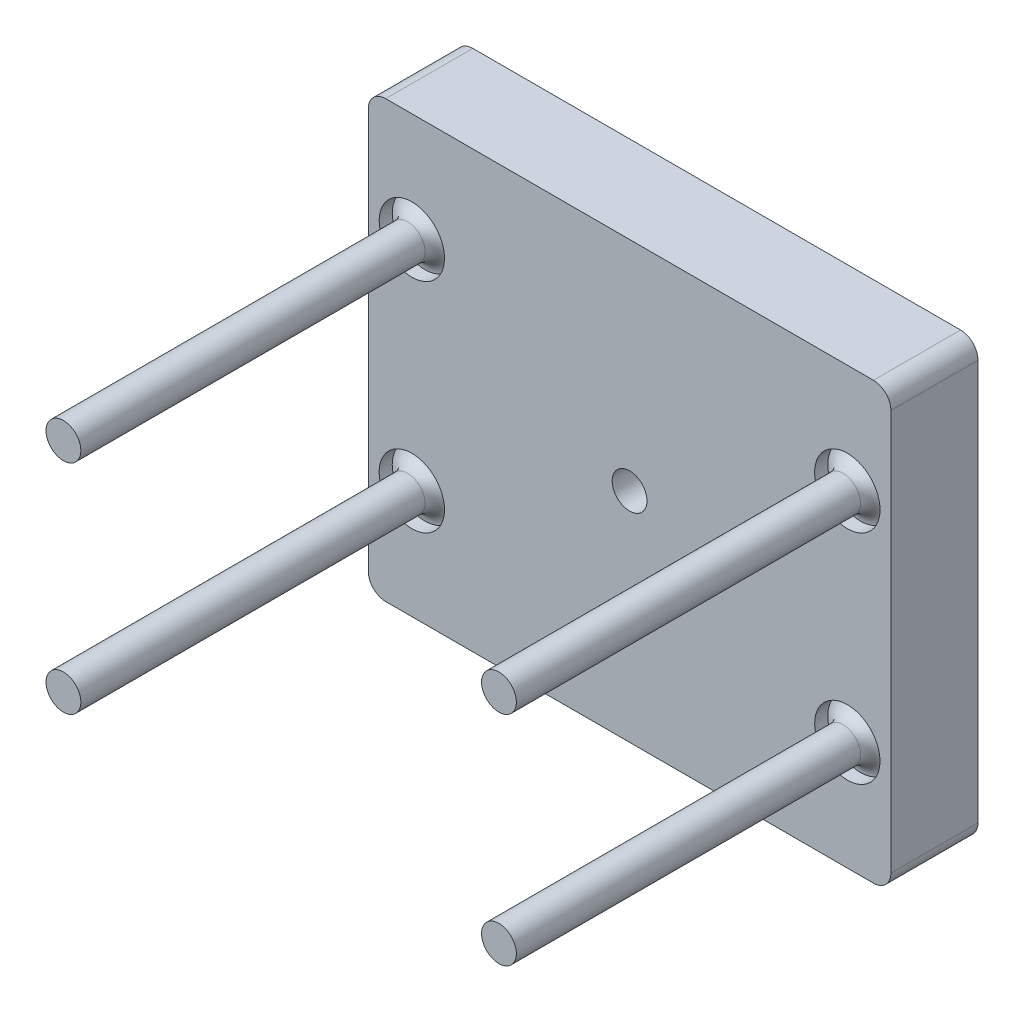
ISO-10303-21;
HEADER;
FILE_DESCRIPTION(('STEP AP214'),'2;1');
FILE_NAME('part.step','',(''),(''),'','','');
FILE_SCHEMA(('AUTOMOTIVE_DESIGN { 1 0 10303 214 1 1 1 1 }'));
ENDSEC;
DATA;
#1=APPLICATION_CONTEXT('core data for automotive mechanical design processes');
#2=APPLICATION_PROTOCOL_DEFINITION('international standard','automotive_design',2000,#1);
#3=PRODUCT_CONTEXT('',#1,'mechanical');
#4=PRODUCT('Part','Part','',(#3));
#5=PRODUCT_RELATED_PRODUCT_CATEGORY('part','',(#4));
#6=PRODUCT_DEFINITION_FORMATION('','',#4);
#7=PRODUCT_DEFINITION_CONTEXT('part definition',#1,'design');
#8=PRODUCT_DEFINITION('design','',#6,#7);
#9=PRODUCT_DEFINITION_SHAPE('','',#8);
#10=(LENGTH_UNIT() NAMED_UNIT(*) SI_UNIT(.MILLI.,.METRE.));
#11=(NAMED_UNIT(*) PLANE_ANGLE_UNIT() SI_UNIT($,.RADIAN.));
#12=(NAMED_UNIT(*) SI_UNIT($,.STERADIAN.) SOLID_ANGLE_UNIT());
#13=UNCERTAINTY_MEASURE_WITH_UNIT(LENGTH_MEASURE(1.E-05),#10,'distance_accuracy_value','');
#14=(GEOMETRIC_REPRESENTATION_CONTEXT(3) GLOBAL_UNCERTAINTY_ASSIGNED_CONTEXT((#13)) GLOBAL_UNIT_ASSIGNED_CONTEXT((#10,
#11,#12)) REPRESENTATION_CONTEXT('',''));
#15=CARTESIAN_POINT('',(0.,0.,0.));
#16=DIRECTION('',(0.,0.,1.));
#17=DIRECTION('',(1.,0.,0.));
#18=AXIS2_PLACEMENT_3D('',#15,#16,#17);
#19=CARTESIAN_POINT('',(0.,0.,5.));
#20=DIRECTION('',(1.,0.,0.));
#21=DIRECTION('',(0.,1.,0.));
#22=AXIS2_PLACEMENT_3D('',#19,#20,#21);
#23=PLANE('',#22);
#24=DIRECTION('',(0.,-1.,0.));
#25=VECTOR('',#24,1.);
#26=CARTESIAN_POINT('',(0.,0.,-5.));
#27=LINE('',#26,#25);
#28=CARTESIAN_POINT('',(0.,-2.,-5.));
#29=VERTEX_POINT('',#28);
#30=CARTESIAN_POINT('',(0.,-48.,-5.));
#31=VERTEX_POINT('',#30);
#32=EDGE_CURVE('E123',#29,#31,#27,.T.);
#33=ORIENTED_EDGE('',*,*,#32,.T.);
#34=DIRECTION('',(0.,0.,-1.));
#35=VECTOR('',#34,1.);
#36=CARTESIAN_POINT('',(0.,-48.,5.));
#37=LINE('',#36,#35);
#38=CARTESIAN_POINT('',(0.,-48.,5.));
#39=VERTEX_POINT('',#38);
#40=EDGE_CURVE('E173',#31,#39,#37,.F.);
#41=ORIENTED_EDGE('',*,*,#40,.T.);
#42=DIRECTION('',(0.,-1.,0.));
#43=VECTOR('',#42,1.);
#44=CARTESIAN_POINT('',(0.,0.,5.));
#45=LINE('',#44,#43);
#46=CARTESIAN_POINT('',(0.,-2.,5.));
#47=VERTEX_POINT('',#46);
#48=EDGE_CURVE('E126',#47,#39,#45,.T.);
#49=ORIENTED_EDGE('',*,*,#48,.F.);
#50=DIRECTION('',(0.,0.,-1.));
#51=VECTOR('',#50,1.);
#52=CARTESIAN_POINT('',(0.,-2.,5.));
#53=LINE('',#52,#51);
#54=EDGE_CURVE('E112',#47,#29,#53,.T.);
#55=ORIENTED_EDGE('',*,*,#54,.T.);
#56=EDGE_LOOP('',(#33,#41,#49,#55));
#57=FACE_BOUND('',#56,.T.);
#58=ADVANCED_FACE('F39',(#57),#23,.F.);
#59=CARTESIAN_POINT('',(0.,-50.,5.));
#60=DIRECTION('',(0.,1.,0.));
#61=DIRECTION('',(0.,0.,1.));
#62=AXIS2_PLACEMENT_3D('',#59,#60,#61);
#63=PLANE('',#62);
#64=DIRECTION('',(1.,0.,0.));
#65=VECTOR('',#64,1.);
#66=CARTESIAN_POINT('',(0.,-50.,5.));
#67=LINE('',#66,#65);
#68=CARTESIAN_POINT('',(2.00000000000001,-50.,5.));
#69=VERTEX_POINT('',#68);
#70=CARTESIAN_POINT('',(58.,-50.,5.));
#71=VERTEX_POINT('',#70);
#72=EDGE_CURVE('E285',#69,#71,#67,.T.);
#73=ORIENTED_EDGE('',*,*,#72,.F.);
#74=DIRECTION('',(0.,0.,-1.));
#75=VECTOR('',#74,1.);
#76=CARTESIAN_POINT('',(2.00000000000001,-50.,5.));
#77=LINE('',#76,#75);
#78=CARTESIAN_POINT('',(2.00000000000001,-50.,-5.));
#79=VERTEX_POINT('',#78);
#80=EDGE_CURVE('E161',#69,#79,#77,.T.);
#81=ORIENTED_EDGE('',*,*,#80,.T.);
#82=DIRECTION('',(1.,0.,0.));
#83=VECTOR('',#82,1.);
#84=CARTESIAN_POINT('',(0.,-50.,-5.));
#85=LINE('',#84,#83);
#86=CARTESIAN_POINT('',(58.,-50.,-5.));
#87=VERTEX_POINT('',#86);
#88=EDGE_CURVE('E134',#79,#87,#85,.T.);
#89=ORIENTED_EDGE('',*,*,#88,.T.);
#90=DIRECTION('',(0.,0.,-1.));
#91=VECTOR('',#90,1.);
#92=CARTESIAN_POINT('',(58.,-50.,5.));
#93=LINE('',#92,#91);
#94=EDGE_CURVE('E158',#87,#71,#93,.F.);
#95=ORIENTED_EDGE('',*,*,#94,.T.);
#96=EDGE_LOOP('',(#73,#81,#89,#95));
#97=FACE_BOUND('',#96,.T.);
#98=ADVANCED_FACE('F222',(#97),#63,.F.);
#99=CARTESIAN_POINT('',(60.,0.,5.));
#100=DIRECTION('',(-1.,0.,0.));
#101=DIRECTION('',(0.,-1.,0.));
#102=AXIS2_PLACEMENT_3D('',#99,#100,#101);
#103=PLANE('',#102);
#104=DIRECTION('',(0.,1.,0.));
#105=VECTOR('',#104,1.);
#106=CARTESIAN_POINT('',(60.,0.,5.));
#107=LINE('',#106,#105);
#108=CARTESIAN_POINT('',(60.,-48.,5.));
#109=VERTEX_POINT('',#108);
#110=CARTESIAN_POINT('',(60.,-2.,5.));
#111=VERTEX_POINT('',#110);
#112=EDGE_CURVE('E287',#109,#111,#107,.T.);
#113=ORIENTED_EDGE('',*,*,#112,.F.);
#114=DIRECTION('',(0.,0.,-1.));
#115=VECTOR('',#114,1.);
#116=CARTESIAN_POINT('',(60.,-48.,5.));
#117=LINE('',#116,#115);
#118=CARTESIAN_POINT('',(60.,-48.,-5.));
#119=VERTEX_POINT('',#118);
#120=EDGE_CURVE('E186',#109,#119,#117,.T.);
#121=ORIENTED_EDGE('',*,*,#120,.T.);
#122=DIRECTION('',(0.,1.,0.));
#123=VECTOR('',#122,1.);
#124=CARTESIAN_POINT('',(60.,0.,-5.));
#125=LINE('',#124,#123);
#126=CARTESIAN_POINT('',(60.,-2.,-5.));
#127=VERTEX_POINT('',#126);
#128=EDGE_CURVE('E140',#119,#127,#125,.T.);
#129=ORIENTED_EDGE('',*,*,#128,.T.);
#130=DIRECTION('',(0.,0.,-1.));
#131=VECTOR('',#130,1.);
#132=CARTESIAN_POINT('',(60.,-2.,5.));
#133=LINE('',#132,#131);
#134=EDGE_CURVE('E55',#127,#111,#133,.F.);
#135=ORIENTED_EDGE('',*,*,#134,.T.);
#136=EDGE_LOOP('',(#113,#121,#129,#135));
#137=FACE_BOUND('',#136,.T.);
#138=ADVANCED_FACE('F227',(#137),#103,.F.);
#139=CARTESIAN_POINT('',(0.,0.,5.));
#140=DIRECTION('',(0.,-1.,0.));
#141=DIRECTION('',(0.,0.,-1.));
#142=AXIS2_PLACEMENT_3D('',#139,#140,#141);
#143=PLANE('',#142);
#144=DIRECTION('',(-1.,0.,0.));
#145=VECTOR('',#144,1.);
#146=CARTESIAN_POINT('',(0.,0.,5.));
#147=LINE('',#146,#145);
#148=CARTESIAN_POINT('',(58.,0.,5.));
#149=VERTEX_POINT('',#148);
#150=CARTESIAN_POINT('',(2.,0.,5.));
#151=VERTEX_POINT('',#150);
#152=EDGE_CURVE('E128',#149,#151,#147,.T.);
#153=ORIENTED_EDGE('',*,*,#152,.F.);
#154=DIRECTION('',(0.,0.,-1.));
#155=VECTOR('',#154,1.);
#156=CARTESIAN_POINT('',(58.,0.,5.));
#157=LINE('',#156,#155);
#158=CARTESIAN_POINT('',(58.,0.,-5.));
#159=VERTEX_POINT('',#158);
#160=EDGE_CURVE('E190',#149,#159,#157,.T.);
#161=ORIENTED_EDGE('',*,*,#160,.T.);
#162=DIRECTION('',(-1.,0.,0.));
#163=VECTOR('',#162,1.);
#164=CARTESIAN_POINT('',(0.,0.,-5.));
#165=LINE('',#164,#163);
#166=CARTESIAN_POINT('',(2.,0.,-5.));
#167=VERTEX_POINT('',#166);
#168=EDGE_CURVE('E150',#159,#167,#165,.T.);
#169=ORIENTED_EDGE('',*,*,#168,.T.);
#170=DIRECTION('',(0.,0.,-1.));
#171=VECTOR('',#170,1.);
#172=CARTESIAN_POINT('',(2.,0.,5.));
#173=LINE('',#172,#171);
#174=EDGE_CURVE('E114',#167,#151,#173,.F.);
#175=ORIENTED_EDGE('',*,*,#174,.T.);
#176=EDGE_LOOP('',(#153,#161,#169,#175));
#177=FACE_BOUND('',#176,.T.);
#178=ADVANCED_FACE('F295',(#177),#143,.F.);
#179=CARTESIAN_POINT('',(0.,0.,5.));
#180=DIRECTION('',(0.,0.,1.));
#181=DIRECTION('',(1.,0.,0.));
#182=AXIS2_PLACEMENT_3D('',#179,#180,#181);
#183=PLANE('',#182);
#184=CARTESIAN_POINT('',(55.,-37.5,5.));
#185=DIRECTION('',(0.,0.,1.));
#186=DIRECTION('',(-1.,0.,0.));
#187=AXIS2_PLACEMENT_3D('',#184,#185,#186);
#188=CIRCLE('',#187,3.75);
#189=CARTESIAN_POINT('',(51.25,-37.5,5.));
#190=VERTEX_POINT('',#189);
#191=EDGE_CURVE('E376',#190,#190,#188,.T.);
#192=ORIENTED_EDGE('',*,*,#191,.F.);
#193=EDGE_LOOP('',(#192));
#194=FACE_BOUND('',#193,.T.);
#195=CARTESIAN_POINT('',(55.,-12.5,5.));
#196=DIRECTION('',(0.,0.,1.));
#197=DIRECTION('',(1.,0.,0.));
#198=AXIS2_PLACEMENT_3D('',#195,#196,#197);
#199=CIRCLE('',#198,3.75);
#200=CARTESIAN_POINT('',(58.75,-12.5,5.));
#201=VERTEX_POINT('',#200);
#202=EDGE_CURVE('E368',#201,#201,#199,.T.);
#203=ORIENTED_EDGE('',*,*,#202,.F.);
#204=EDGE_LOOP('',(#203));
#205=FACE_BOUND('',#204,.T.);
#206=CARTESIAN_POINT('',(5.,-12.5,5.));
#207=DIRECTION('',(0.,0.,1.));
#208=DIRECTION('',(-1.,0.,0.));
#209=AXIS2_PLACEMENT_3D('',#206,#207,#208);
#210=CIRCLE('',#209,3.75);
#211=CARTESIAN_POINT('',(1.25,-12.5,5.));
#212=VERTEX_POINT('',#211);
#213=EDGE_CURVE('E358',#212,#212,#210,.T.);
#214=ORIENTED_EDGE('',*,*,#213,.F.);
#215=EDGE_LOOP('',(#214));
#216=FACE_BOUND('',#215,.T.);
#217=CARTESIAN_POINT('',(5.,-37.5,5.));
#218=DIRECTION('',(0.,0.,1.));
#219=DIRECTION('',(1.,0.,0.));
#220=AXIS2_PLACEMENT_3D('',#217,#218,#219);
#221=CIRCLE('',#220,3.75);
#222=CARTESIAN_POINT('',(8.75,-37.5,5.));
#223=VERTEX_POINT('',#222);
#224=EDGE_CURVE('E365',#223,#223,#221,.T.);
#225=ORIENTED_EDGE('',*,*,#224,.F.);
#226=EDGE_LOOP('',(#225));
#227=FACE_BOUND('',#226,.T.);
#228=CARTESIAN_POINT('',(30.,-25.,5.));
#229=DIRECTION('',(0.,0.,1.));
#230=DIRECTION('',(1.,0.,0.));
#231=AXIS2_PLACEMENT_3D('',#228,#229,#230);
#232=CIRCLE('',#231,2.);
#233=CARTESIAN_POINT('',(32.,-25.,5.));
#234=VERTEX_POINT('',#233);
#235=EDGE_CURVE('E384',#234,#234,#232,.T.);
#236=ORIENTED_EDGE('',*,*,#235,.F.);
#237=EDGE_LOOP('',(#236));
#238=FACE_BOUND('',#237,.T.);
#239=ORIENTED_EDGE('',*,*,#48,.T.);
#240=CARTESIAN_POINT('',(2.00000000000001,-48.,5.));
#241=DIRECTION('',(0.,0.,1.));
#242=DIRECTION('',(1.,0.,0.));
#243=AXIS2_PLACEMENT_3D('',#240,#241,#242);
#244=CIRCLE('',#243,2.);
#245=EDGE_CURVE('E181',#39,#69,#244,.T.);
#246=ORIENTED_EDGE('',*,*,#245,.T.);
#247=ORIENTED_EDGE('',*,*,#72,.T.);
#248=CARTESIAN_POINT('',(58.,-48.,5.));
#249=DIRECTION('',(0.,0.,1.));
#250=DIRECTION('',(1.,0.,0.));
#251=AXIS2_PLACEMENT_3D('',#248,#249,#250);
#252=CIRCLE('',#251,2.);
#253=EDGE_CURVE('E62',#71,#109,#252,.T.);
#254=ORIENTED_EDGE('',*,*,#253,.T.);
#255=ORIENTED_EDGE('',*,*,#112,.T.);
#256=CARTESIAN_POINT('',(58.,-2.,5.));
#257=DIRECTION('',(0.,0.,1.));
#258=DIRECTION('',(1.,0.,0.));
#259=AXIS2_PLACEMENT_3D('',#256,#257,#258);
#260=CIRCLE('',#259,2.);
#261=EDGE_CURVE('E176',#111,#149,#260,.T.);
#262=ORIENTED_EDGE('',*,*,#261,.T.);
#263=ORIENTED_EDGE('',*,*,#152,.T.);
#264=CARTESIAN_POINT('',(2.,-2.,5.));
#265=DIRECTION('',(0.,0.,1.));
#266=DIRECTION('',(1.,0.,0.));
#267=AXIS2_PLACEMENT_3D('',#264,#265,#266);
#268=CIRCLE('',#267,2.);
#269=EDGE_CURVE('E155',#151,#47,#268,.T.);
#270=ORIENTED_EDGE('',*,*,#269,.T.);
#271=EDGE_LOOP('',(#239,#246,#247,#254,#255,#262,#263,#270));
#272=FACE_BOUND('',#271,.T.);
#273=ADVANCED_FACE('F292',(#194,#205,#216,#227,#238,#272),#183,.T.);
#274=CARTESIAN_POINT('',(0.,0.,-5.));
#275=DIRECTION('',(0.,0.,1.));
#276=DIRECTION('',(1.,0.,0.));
#277=AXIS2_PLACEMENT_3D('',#274,#275,#276);
#278=PLANE('',#277);
#279=CARTESIAN_POINT('',(30.,-25.,-5.));
#280=DIRECTION('',(0.,0.,1.));
#281=DIRECTION('',(1.,0.,0.));
#282=AXIS2_PLACEMENT_3D('',#279,#280,#281);
#283=CIRCLE('',#282,2.);
#284=CARTESIAN_POINT('',(32.,-25.,-5.));
#285=VERTEX_POINT('',#284);
#286=EDGE_CURVE('E279',#285,#285,#283,.T.);
#287=ORIENTED_EDGE('',*,*,#286,.T.);
#288=EDGE_LOOP('',(#287));
#289=FACE_BOUND('',#288,.T.);
#290=ORIENTED_EDGE('',*,*,#88,.F.);
#291=CARTESIAN_POINT('',(2.00000000000001,-48.,-5.));
#292=DIRECTION('',(0.,0.,1.));
#293=DIRECTION('',(1.,0.,0.));
#294=AXIS2_PLACEMENT_3D('',#291,#292,#293);
#295=CIRCLE('',#294,2.);
#296=EDGE_CURVE('E132',#79,#31,#295,.F.);
#297=ORIENTED_EDGE('',*,*,#296,.T.);
#298=ORIENTED_EDGE('',*,*,#32,.F.);
#299=CARTESIAN_POINT('',(2.,-2.,-5.));
#300=DIRECTION('',(0.,0.,1.));
#301=DIRECTION('',(1.,0.,0.));
#302=AXIS2_PLACEMENT_3D('',#299,#300,#301);
#303=CIRCLE('',#302,2.);
#304=EDGE_CURVE('E108',#29,#167,#303,.F.);
#305=ORIENTED_EDGE('',*,*,#304,.T.);
#306=ORIENTED_EDGE('',*,*,#168,.F.);
#307=CARTESIAN_POINT('',(58.,-2.,-5.));
#308=DIRECTION('',(0.,0.,1.));
#309=DIRECTION('',(1.,0.,0.));
#310=AXIS2_PLACEMENT_3D('',#307,#308,#309);
#311=CIRCLE('',#310,2.);
#312=EDGE_CURVE('E165',#159,#127,#311,.F.);
#313=ORIENTED_EDGE('',*,*,#312,.T.);
#314=ORIENTED_EDGE('',*,*,#128,.F.);
#315=CARTESIAN_POINT('',(58.,-48.,-5.));
#316=DIRECTION('',(0.,0.,1.));
#317=DIRECTION('',(1.,0.,0.));
#318=AXIS2_PLACEMENT_3D('',#315,#316,#317);
#319=CIRCLE('',#318,2.);
#320=EDGE_CURVE('E168',#119,#87,#319,.F.);
#321=ORIENTED_EDGE('',*,*,#320,.T.);
#322=EDGE_LOOP('',(#290,#297,#298,#305,#306,#313,#314,#321));
#323=FACE_BOUND('',#322,.T.);
#324=ADVANCED_FACE('F131',(#289,#323),#278,.F.);
#325=CARTESIAN_POINT('',(30.,-25.,-5.));
#326=DIRECTION('',(0.,0.,1.));
#327=DIRECTION('',(1.,0.,0.));
#328=AXIS2_PLACEMENT_3D('',#325,#326,#327);
#329=CYLINDRICAL_SURFACE('',#328,2.);
#330=ORIENTED_EDGE('',*,*,#286,.F.);
#331=EDGE_LOOP('',(#330));
#332=FACE_BOUND('',#331,.T.);
#333=ORIENTED_EDGE('',*,*,#235,.T.);
#334=EDGE_LOOP('',(#333));
#335=FACE_BOUND('',#334,.T.);
#336=ADVANCED_FACE('F235',(#332,#335),#329,.F.);
#337=CARTESIAN_POINT('',(2.,-2.,5.));
#338=DIRECTION('',(0.,0.,-1.));
#339=DIRECTION('',(-1.,0.,0.));
#340=AXIS2_PLACEMENT_3D('',#337,#338,#339);
#341=CYLINDRICAL_SURFACE('',#340,2.);
#342=ORIENTED_EDGE('',*,*,#269,.F.);
#343=ORIENTED_EDGE('',*,*,#174,.F.);
#344=ORIENTED_EDGE('',*,*,#304,.F.);
#345=ORIENTED_EDGE('',*,*,#54,.F.);
#346=EDGE_LOOP('',(#342,#343,#344,#345));
#347=FACE_BOUND('',#346,.T.);
#348=ADVANCED_FACE('F111',(#347),#341,.T.);
#349=CARTESIAN_POINT('',(2.00000000000001,-48.,5.));
#350=DIRECTION('',(0.,0.,-1.));
#351=DIRECTION('',(-1.,0.,0.));
#352=AXIS2_PLACEMENT_3D('',#349,#350,#351);
#353=CYLINDRICAL_SURFACE('',#352,2.);
#354=ORIENTED_EDGE('',*,*,#245,.F.);
#355=ORIENTED_EDGE('',*,*,#40,.F.);
#356=ORIENTED_EDGE('',*,*,#296,.F.);
#357=ORIENTED_EDGE('',*,*,#80,.F.);
#358=EDGE_LOOP('',(#354,#355,#356,#357));
#359=FACE_BOUND('',#358,.T.);
#360=ADVANCED_FACE('F234',(#359),#353,.T.);
#361=CARTESIAN_POINT('',(58.,-48.,5.));
#362=DIRECTION('',(0.,0.,-1.));
#363=DIRECTION('',(-1.,0.,0.));
#364=AXIS2_PLACEMENT_3D('',#361,#362,#363);
#365=CYLINDRICAL_SURFACE('',#364,2.);
#366=ORIENTED_EDGE('',*,*,#253,.F.);
#367=ORIENTED_EDGE('',*,*,#94,.F.);
#368=ORIENTED_EDGE('',*,*,#320,.F.);
#369=ORIENTED_EDGE('',*,*,#120,.F.);
#370=EDGE_LOOP('',(#366,#367,#368,#369));
#371=FACE_BOUND('',#370,.T.);
#372=ADVANCED_FACE('F238',(#371),#365,.T.);
#373=CARTESIAN_POINT('',(58.,-2.,5.));
#374=DIRECTION('',(0.,0.,-1.));
#375=DIRECTION('',(-1.,0.,0.));
#376=AXIS2_PLACEMENT_3D('',#373,#374,#375);
#377=CYLINDRICAL_SURFACE('',#376,2.);
#378=ORIENTED_EDGE('',*,*,#261,.F.);
#379=ORIENTED_EDGE('',*,*,#134,.F.);
#380=ORIENTED_EDGE('',*,*,#312,.F.);
#381=ORIENTED_EDGE('',*,*,#160,.F.);
#382=EDGE_LOOP('',(#378,#379,#380,#381));
#383=FACE_BOUND('',#382,.T.);
#384=ADVANCED_FACE('F242',(#383),#377,.T.);
#385=CARTESIAN_POINT('',(55.,-12.5,3.5));
#386=DIRECTION('',(0.,0.,1.));
#387=DIRECTION('',(1.,0.,0.));
#388=AXIS2_PLACEMENT_3D('',#385,#386,#387);
#389=CYLINDRICAL_SURFACE('',#388,3.75);
#390=CARTESIAN_POINT('',(55.,-12.5,3.5));
#391=DIRECTION('',(0.,0.,1.));
#392=DIRECTION('',(1.,0.,0.));
#393=AXIS2_PLACEMENT_3D('',#390,#391,#392);
#394=CIRCLE('',#393,3.75);
#395=CARTESIAN_POINT('',(58.75,-12.5,3.5));
#396=VERTEX_POINT('',#395);
#397=EDGE_CURVE('E361',#396,#396,#394,.T.);
#398=ORIENTED_EDGE('',*,*,#397,.F.);
#399=EDGE_LOOP('',(#398));
#400=FACE_BOUND('',#399,.T.);
#401=ORIENTED_EDGE('',*,*,#202,.T.);
#402=EDGE_LOOP('',(#401));
#403=FACE_BOUND('',#402,.T.);
#404=ADVANCED_FACE('F246',(#400,#403),#389,.F.);
#405=CARTESIAN_POINT('',(55.,-37.5,3.5));
#406=DIRECTION('',(0.,0.,1.));
#407=DIRECTION('',(1.,0.,0.));
#408=AXIS2_PLACEMENT_3D('',#405,#406,#407);
#409=CYLINDRICAL_SURFACE('',#408,3.75);
#410=CARTESIAN_POINT('',(55.,-37.5,3.5));
#411=DIRECTION('',(0.,0.,1.));
#412=DIRECTION('',(-1.,0.,0.));
#413=AXIS2_PLACEMENT_3D('',#410,#411,#412);
#414=CIRCLE('',#413,3.75);
#415=CARTESIAN_POINT('',(51.25,-37.5,3.5));
#416=VERTEX_POINT('',#415);
#417=EDGE_CURVE('E258',#416,#416,#414,.T.);
#418=ORIENTED_EDGE('',*,*,#417,.F.);
#419=EDGE_LOOP('',(#418));
#420=FACE_BOUND('',#419,.T.);
#421=ORIENTED_EDGE('',*,*,#191,.T.);
#422=EDGE_LOOP('',(#421));
#423=FACE_BOUND('',#422,.T.);
#424=ADVANCED_FACE('F341',(#420,#423),#409,.F.);
#425=CARTESIAN_POINT('',(5.,-37.5,3.5));
#426=DIRECTION('',(0.,0.,1.));
#427=DIRECTION('',(1.,0.,0.));
#428=AXIS2_PLACEMENT_3D('',#425,#426,#427);
#429=CYLINDRICAL_SURFACE('',#428,3.75);
#430=CARTESIAN_POINT('',(5.,-37.5,3.5));
#431=DIRECTION('',(0.,0.,1.));
#432=DIRECTION('',(1.,0.,0.));
#433=AXIS2_PLACEMENT_3D('',#430,#431,#432);
#434=CIRCLE('',#433,3.75);
#435=CARTESIAN_POINT('',(8.75,-37.5,3.5));
#436=VERTEX_POINT('',#435);
#437=EDGE_CURVE('E380',#436,#436,#434,.T.);
#438=ORIENTED_EDGE('',*,*,#437,.F.);
#439=EDGE_LOOP('',(#438));
#440=FACE_BOUND('',#439,.T.);
#441=ORIENTED_EDGE('',*,*,#224,.T.);
#442=EDGE_LOOP('',(#441));
#443=FACE_BOUND('',#442,.T.);
#444=ADVANCED_FACE('F338',(#440,#443),#429,.F.);
#445=CARTESIAN_POINT('',(5.,-12.5,3.5));
#446=DIRECTION('',(0.,0.,1.));
#447=DIRECTION('',(1.,0.,0.));
#448=AXIS2_PLACEMENT_3D('',#445,#446,#447);
#449=CYLINDRICAL_SURFACE('',#448,3.75);
#450=CARTESIAN_POINT('',(5.,-12.5,3.5));
#451=DIRECTION('',(0.,0.,1.));
#452=DIRECTION('',(-1.,0.,0.));
#453=AXIS2_PLACEMENT_3D('',#450,#451,#452);
#454=CIRCLE('',#453,3.75);
#455=CARTESIAN_POINT('',(1.25,-12.5,3.5));
#456=VERTEX_POINT('',#455);
#457=EDGE_CURVE('E355',#456,#456,#454,.T.);
#458=ORIENTED_EDGE('',*,*,#457,.F.);
#459=EDGE_LOOP('',(#458));
#460=FACE_BOUND('',#459,.T.);
#461=ORIENTED_EDGE('',*,*,#213,.T.);
#462=EDGE_LOOP('',(#461));
#463=FACE_BOUND('',#462,.T.);
#464=ADVANCED_FACE('F333',(#460,#463),#449,.F.);
#465=CARTESIAN_POINT('',(55.,-12.5,45.));
#466=DIRECTION('',(0.,0.,-1.));
#467=DIRECTION('',(-1.,0.,0.));
#468=AXIS2_PLACEMENT_3D('',#465,#466,#467);
#469=PLANE('',#468);
#470=CARTESIAN_POINT('',(55.,-12.5,45.));
#471=DIRECTION('',(0.,0.,1.));
#472=DIRECTION('',(-1.,0.,0.));
#473=AXIS2_PLACEMENT_3D('',#470,#471,#472);
#474=CIRCLE('',#473,2.);
#475=CARTESIAN_POINT('',(53.,-12.5,45.));
#476=VERTEX_POINT('',#475);
#477=EDGE_CURVE('E272',#476,#476,#474,.T.);
#478=ORIENTED_EDGE('',*,*,#477,.T.);
#479=EDGE_LOOP('',(#478));
#480=FACE_BOUND('',#479,.T.);
#481=ADVANCED_FACE('F329',(#480),#469,.F.);
#482=CARTESIAN_POINT('',(55.,-12.5,45.));
#483=DIRECTION('',(0.,0.,-1.));
#484=DIRECTION('',(-1.,0.,0.));
#485=AXIS2_PLACEMENT_3D('',#482,#483,#484);
#486=CYLINDRICAL_SURFACE('',#485,2.);
#487=CARTESIAN_POINT('',(55.,-12.5,5.48431348329844));
#488=DIRECTION('',(0.,0.,-1.));
#489=DIRECTION('',(-1.,0.,0.));
#490=AXIS2_PLACEMENT_3D('',#487,#488,#489);
#491=CIRCLE('',#490,2.);
#492=CARTESIAN_POINT('',(53.,-12.5,5.48431348329844));
#493=VERTEX_POINT('',#492);
#494=EDGE_CURVE('E198',#493,#493,#491,.F.);
#495=ORIENTED_EDGE('',*,*,#494,.T.);
#496=EDGE_LOOP('',(#495));
#497=FACE_BOUND('',#496,.T.);
#498=ORIENTED_EDGE('',*,*,#477,.F.);
#499=EDGE_LOOP('',(#498));
#500=FACE_BOUND('',#499,.T.);
#501=ADVANCED_FACE('F326',(#497,#500),#486,.T.);
#502=CARTESIAN_POINT('',(55.,-37.5,45.));
#503=DIRECTION('',(0.,0.,1.));
#504=DIRECTION('',(1.,0.,0.));
#505=AXIS2_PLACEMENT_3D('',#502,#503,#504);
#506=PLANE('',#505);
#507=CARTESIAN_POINT('',(55.,-37.5,45.));
#508=DIRECTION('',(0.,0.,1.));
#509=DIRECTION('',(1.,0.,0.));
#510=AXIS2_PLACEMENT_3D('',#507,#508,#509);
#511=CIRCLE('',#510,2.);
#512=CARTESIAN_POINT('',(57.,-37.5,45.));
#513=VERTEX_POINT('',#512);
#514=EDGE_CURVE('E269',#513,#513,#511,.T.);
#515=ORIENTED_EDGE('',*,*,#514,.T.);
#516=EDGE_LOOP('',(#515));
#517=FACE_BOUND('',#516,.T.);
#518=ADVANCED_FACE('F265',(#517),#506,.T.);
#519=CARTESIAN_POINT('',(55.,-37.5,45.));
#520=DIRECTION('',(0.,0.,-1.));
#521=DIRECTION('',(-1.,0.,0.));
#522=AXIS2_PLACEMENT_3D('',#519,#520,#521);
#523=CYLINDRICAL_SURFACE('',#522,2.);
#524=CARTESIAN_POINT('',(55.,-37.5,5.48431348329844));
#525=DIRECTION('',(0.,0.,-1.));
#526=DIRECTION('',(-1.,0.,0.));
#527=AXIS2_PLACEMENT_3D('',#524,#525,#526);
#528=CIRCLE('',#527,2.);
#529=CARTESIAN_POINT('',(53.,-37.5,5.48431348329844));
#530=VERTEX_POINT('',#529);
#531=EDGE_CURVE('E194',#530,#530,#528,.F.);
#532=ORIENTED_EDGE('',*,*,#531,.T.);
#533=EDGE_LOOP('',(#532));
#534=FACE_BOUND('',#533,.T.);
#535=ORIENTED_EDGE('',*,*,#514,.F.);
#536=EDGE_LOOP('',(#535));
#537=FACE_BOUND('',#536,.T.);
#538=ADVANCED_FACE('F261',(#534,#537),#523,.T.);
#539=CARTESIAN_POINT('',(5.,-37.5,45.));
#540=DIRECTION('',(0.,0.,-1.));
#541=DIRECTION('',(-1.,0.,0.));
#542=AXIS2_PLACEMENT_3D('',#539,#540,#541);
#543=PLANE('',#542);
#544=CARTESIAN_POINT('',(5.,-37.5,45.));
#545=DIRECTION('',(0.,0.,1.));
#546=DIRECTION('',(-1.,0.,0.));
#547=AXIS2_PLACEMENT_3D('',#544,#545,#546);
#548=CIRCLE('',#547,2.);
#549=CARTESIAN_POINT('',(3.,-37.5,45.));
#550=VERTEX_POINT('',#549);
#551=EDGE_CURVE('E143',#550,#550,#548,.T.);
#552=ORIENTED_EDGE('',*,*,#551,.T.);
#553=EDGE_LOOP('',(#552));
#554=FACE_BOUND('',#553,.T.);
#555=ADVANCED_FACE('F264',(#554),#543,.F.);
#556=CARTESIAN_POINT('',(5.,-37.5,45.));
#557=DIRECTION('',(0.,0.,-1.));
#558=DIRECTION('',(-1.,0.,0.));
#559=AXIS2_PLACEMENT_3D('',#556,#557,#558);
#560=CYLINDRICAL_SURFACE('',#559,2.);
#561=CARTESIAN_POINT('',(5.,-37.5,5.48431348329844));
#562=DIRECTION('',(0.,0.,-1.));
#563=DIRECTION('',(-1.,0.,0.));
#564=AXIS2_PLACEMENT_3D('',#561,#562,#563);
#565=CIRCLE('',#564,2.);
#566=CARTESIAN_POINT('',(3.,-37.5,5.48431348329844));
#567=VERTEX_POINT('',#566);
#568=EDGE_CURVE('E11',#567,#567,#565,.F.);
#569=ORIENTED_EDGE('',*,*,#568,.T.);
#570=EDGE_LOOP('',(#569));
#571=FACE_BOUND('',#570,.T.);
#572=ORIENTED_EDGE('',*,*,#551,.F.);
#573=EDGE_LOOP('',(#572));
#574=FACE_BOUND('',#573,.T.);
#575=ADVANCED_FACE('F316',(#571,#574),#560,.T.);
#576=CARTESIAN_POINT('',(5.,-12.5,45.));
#577=DIRECTION('',(0.,0.,1.));
#578=DIRECTION('',(1.,0.,0.));
#579=AXIS2_PLACEMENT_3D('',#576,#577,#578);
#580=PLANE('',#579);
#581=CARTESIAN_POINT('',(5.,-12.5,45.));
#582=DIRECTION('',(0.,0.,1.));
#583=DIRECTION('',(1.,0.,0.));
#584=AXIS2_PLACEMENT_3D('',#581,#582,#583);
#585=CIRCLE('',#584,2.);
#586=CARTESIAN_POINT('',(7.,-12.5,45.));
#587=VERTEX_POINT('',#586);
#588=EDGE_CURVE('E135',#587,#587,#585,.T.);
#589=ORIENTED_EDGE('',*,*,#588,.T.);
#590=EDGE_LOOP('',(#589));
#591=FACE_BOUND('',#590,.T.);
#592=ADVANCED_FACE('F253',(#591),#580,.T.);
#593=CARTESIAN_POINT('',(5.,-12.5,45.));
#594=DIRECTION('',(0.,0.,-1.));
#595=DIRECTION('',(-1.,0.,0.));
#596=AXIS2_PLACEMENT_3D('',#593,#594,#595);
#597=CYLINDRICAL_SURFACE('',#596,2.);
#598=CARTESIAN_POINT('',(5.,-12.5,5.48431348329844));
#599=DIRECTION('',(0.,0.,-1.));
#600=DIRECTION('',(-1.,0.,0.));
#601=AXIS2_PLACEMENT_3D('',#598,#599,#600);
#602=CIRCLE('',#601,2.);
#603=CARTESIAN_POINT('',(3.,-12.5,5.48431348329844));
#604=VERTEX_POINT('',#603);
#605=EDGE_CURVE('E48',#604,#604,#602,.F.);
#606=ORIENTED_EDGE('',*,*,#605,.T.);
#607=EDGE_LOOP('',(#606));
#608=FACE_BOUND('',#607,.T.);
#609=ORIENTED_EDGE('',*,*,#588,.F.);
#610=EDGE_LOOP('',(#609));
#611=FACE_BOUND('',#610,.T.);
#612=ADVANCED_FACE('F205',(#608,#611),#597,.T.);
#613=CARTESIAN_POINT('',(55.,-37.5,5.48431348329844));
#614=DIRECTION('',(0.,0.,-1.));
#615=DIRECTION('',(-1.,0.,0.));
#616=AXIS2_PLACEMENT_3D('',#613,#614,#615);
#617=TOROIDAL_SURFACE('',#616,4.,2.);
#618=ORIENTED_EDGE('',*,*,#417,.T.);
#619=EDGE_LOOP('',(#618));
#620=FACE_BOUND('',#619,.T.);
#621=ORIENTED_EDGE('',*,*,#531,.F.);
#622=EDGE_LOOP('',(#621));
#623=FACE_BOUND('',#622,.T.);
#624=ADVANCED_FACE('F217',(#620,#623),#617,.F.);
#625=CARTESIAN_POINT('',(55.,-12.5,5.48431348329844));
#626=DIRECTION('',(0.,0.,-1.));
#627=DIRECTION('',(-1.,0.,0.));
#628=AXIS2_PLACEMENT_3D('',#625,#626,#627);
#629=TOROIDAL_SURFACE('',#628,4.,2.);
#630=ORIENTED_EDGE('',*,*,#397,.T.);
#631=EDGE_LOOP('',(#630));
#632=FACE_BOUND('',#631,.T.);
#633=ORIENTED_EDGE('',*,*,#494,.F.);
#634=EDGE_LOOP('',(#633));
#635=FACE_BOUND('',#634,.T.);
#636=ADVANCED_FACE('F210',(#632,#635),#629,.F.);
#637=CARTESIAN_POINT('',(5.,-12.5,5.48431348329844));
#638=DIRECTION('',(0.,0.,-1.));
#639=DIRECTION('',(-1.,0.,0.));
#640=AXIS2_PLACEMENT_3D('',#637,#638,#639);
#641=TOROIDAL_SURFACE('',#640,4.,2.);
#642=ORIENTED_EDGE('',*,*,#457,.T.);
#643=EDGE_LOOP('',(#642));
#644=FACE_BOUND('',#643,.T.);
#645=ORIENTED_EDGE('',*,*,#605,.F.);
#646=EDGE_LOOP('',(#645));
#647=FACE_BOUND('',#646,.T.);
#648=ADVANCED_FACE('F208',(#644,#647),#641,.F.);
#649=CARTESIAN_POINT('',(5.,-37.5,5.48431348329844));
#650=DIRECTION('',(0.,0.,-1.));
#651=DIRECTION('',(-1.,0.,0.));
#652=AXIS2_PLACEMENT_3D('',#649,#650,#651);
#653=TOROIDAL_SURFACE('',#652,4.,2.);
#654=ORIENTED_EDGE('',*,*,#437,.T.);
#655=EDGE_LOOP('',(#654));
#656=FACE_BOUND('',#655,.T.);
#657=ORIENTED_EDGE('',*,*,#568,.F.);
#658=EDGE_LOOP('',(#657));
#659=FACE_BOUND('',#658,.T.);
#660=ADVANCED_FACE('F41',(#656,#659),#653,.F.);
#661=CLOSED_SHELL('',(#58,#98,#138,#178,#273,#324,#336,#348,#360,#372,#384,#404,#424,#444,#464,
#481,#501,#518,#538,#555,#575,#592,#612,#624,#636,#648,#660));
#662=MANIFOLD_SOLID_BREP('B2',#661);
#663=ADVANCED_BREP_SHAPE_REPRESENTATION('',(#18,#662),#14);
#664=SHAPE_DEFINITION_REPRESENTATION(#9,#663);
ENDSEC;
END-ISO-10303-21;
